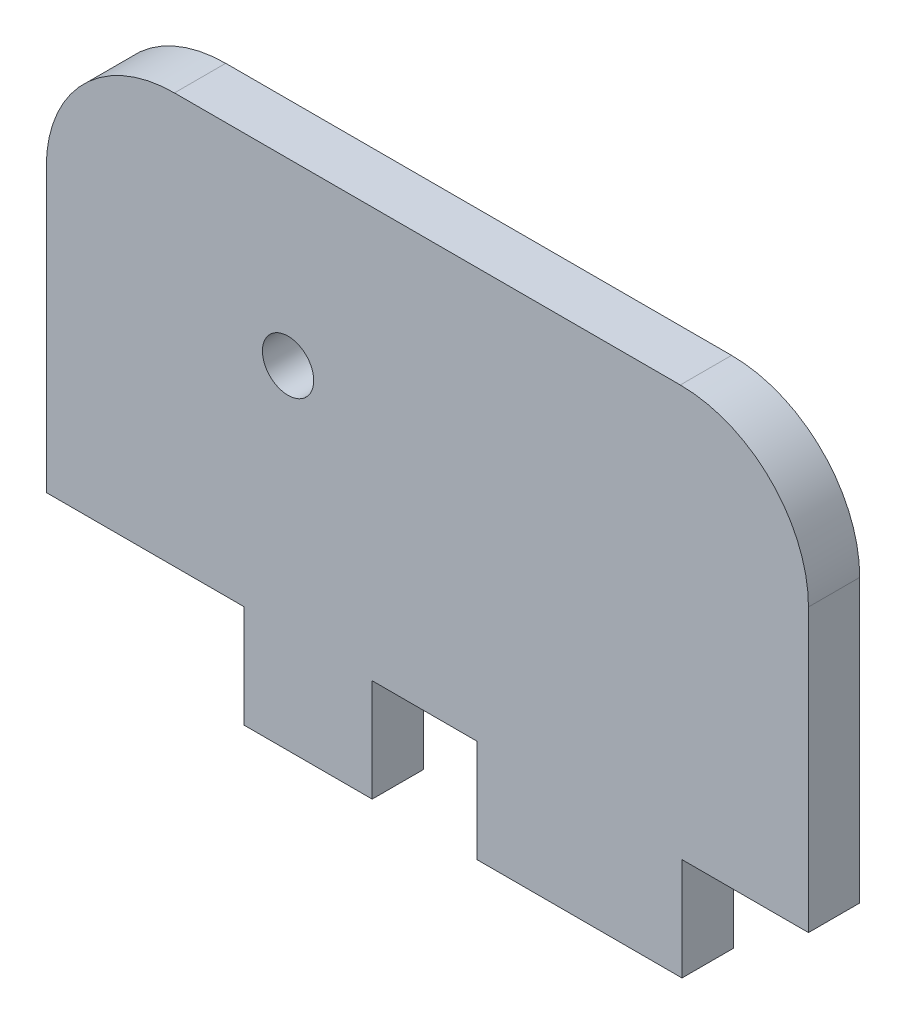
ISO-10303-21;
HEADER;
FILE_DESCRIPTION(('STEP AP214'),'2;1');
FILE_NAME('part.step','',(''),(''),'','','');
FILE_SCHEMA(('AUTOMOTIVE_DESIGN { 1 0 10303 214 1 1 1 1 }'));
ENDSEC;
DATA;
#1=APPLICATION_CONTEXT('core data for automotive mechanical design processes');
#2=APPLICATION_PROTOCOL_DEFINITION('international standard','automotive_design',2000,#1);
#3=PRODUCT_CONTEXT('',#1,'mechanical');
#4=PRODUCT('Part','Part','',(#3));
#5=PRODUCT_RELATED_PRODUCT_CATEGORY('part','',(#4));
#6=PRODUCT_DEFINITION_FORMATION('','',#4);
#7=PRODUCT_DEFINITION_CONTEXT('part definition',#1,'design');
#8=PRODUCT_DEFINITION('design','',#6,#7);
#9=PRODUCT_DEFINITION_SHAPE('','',#8);
#10=(LENGTH_UNIT() NAMED_UNIT(*) SI_UNIT(.MILLI.,.METRE.));
#11=(NAMED_UNIT(*) PLANE_ANGLE_UNIT() SI_UNIT($,.RADIAN.));
#12=(NAMED_UNIT(*) SI_UNIT($,.STERADIAN.) SOLID_ANGLE_UNIT());
#13=UNCERTAINTY_MEASURE_WITH_UNIT(LENGTH_MEASURE(1.E-05),#10,'distance_accuracy_value','');
#14=(GEOMETRIC_REPRESENTATION_CONTEXT(3) GLOBAL_UNCERTAINTY_ASSIGNED_CONTEXT((#13)) GLOBAL_UNIT_ASSIGNED_CONTEXT((#10,
#11,#12)) REPRESENTATION_CONTEXT('',''));
#15=CARTESIAN_POINT('',(0.,0.,0.));
#16=DIRECTION('',(0.,0.,1.));
#17=DIRECTION('',(1.,0.,0.));
#18=AXIS2_PLACEMENT_3D('',#15,#16,#17);
#19=CARTESIAN_POINT('',(-9.86584110472118,10.,2.));
#20=DIRECTION('',(0.,0.,-1.));
#21=DIRECTION('',(-1.,0.,0.));
#22=AXIS2_PLACEMENT_3D('',#19,#20,#21);
#23=PLANE('',#22);
#24=DIRECTION('',(0.,1.,0.));
#25=VECTOR('',#24,1.);
#26=CARTESIAN_POINT('',(-2.15187398526033,-1.,2.));
#27=LINE('',#26,#25);
#28=CARTESIAN_POINT('',(-2.15187398526033,-5.,2.));
#29=VERTEX_POINT('',#28);
#30=CARTESIAN_POINT('',(-2.15187398526033,-1.,2.));
#31=VERTEX_POINT('',#30);
#32=EDGE_CURVE('E193',#29,#31,#27,.T.);
#33=ORIENTED_EDGE('',*,*,#32,.T.);
#34=DIRECTION('',(1.,0.,0.));
#35=VECTOR('',#34,1.);
#36=CARTESIAN_POINT('',(1.93266689999142,-1.,2.));
#37=LINE('',#36,#35);
#38=CARTESIAN_POINT('',(1.93266689999142,-1.,2.));
#39=VERTEX_POINT('',#38);
#40=EDGE_CURVE('E111',#31,#39,#37,.T.);
#41=ORIENTED_EDGE('',*,*,#40,.T.);
#42=DIRECTION('',(0.,-1.,0.));
#43=VECTOR('',#42,1.);
#44=CARTESIAN_POINT('',(1.93266689999142,-5.,2.));
#45=LINE('',#44,#43);
#46=CARTESIAN_POINT('',(1.93266689999142,-5.,2.));
#47=VERTEX_POINT('',#46);
#48=EDGE_CURVE('E226',#39,#47,#45,.T.);
#49=ORIENTED_EDGE('',*,*,#48,.T.);
#50=DIRECTION('',(1.,0.,0.));
#51=VECTOR('',#50,1.);
#52=CARTESIAN_POINT('',(9.93266689999142,-5.,2.));
#53=LINE('',#52,#51);
#54=CARTESIAN_POINT('',(9.93266689999142,-5.,2.));
#55=VERTEX_POINT('',#54);
#56=EDGE_CURVE('E245',#47,#55,#53,.T.);
#57=ORIENTED_EDGE('',*,*,#56,.T.);
#58=DIRECTION('',(0.,1.,0.));
#59=VECTOR('',#58,1.);
#60=CARTESIAN_POINT('',(9.93266689999142,-1.,2.));
#61=LINE('',#60,#59);
#62=CARTESIAN_POINT('',(9.93266689999142,-1.,2.));
#63=VERTEX_POINT('',#62);
#64=EDGE_CURVE('E242',#55,#63,#61,.T.);
#65=ORIENTED_EDGE('',*,*,#64,.T.);
#66=DIRECTION('',(1.,0.,0.));
#67=VECTOR('',#66,1.);
#68=CARTESIAN_POINT('',(9.93266689999142,-1.,2.));
#69=LINE('',#68,#67);
#70=CARTESIAN_POINT('',(14.8658411047212,-1.,2.));
#71=VERTEX_POINT('',#70);
#72=EDGE_CURVE('E244',#63,#71,#69,.T.);
#73=ORIENTED_EDGE('',*,*,#72,.T.);
#74=DIRECTION('',(0.,1.,0.));
#75=VECTOR('',#74,1.);
#76=CARTESIAN_POINT('',(14.8658411047212,9.99999999999996,2.));
#77=LINE('',#76,#75);
#78=CARTESIAN_POINT('',(14.8658411047212,9.99999999999996,2.));
#79=VERTEX_POINT('',#78);
#80=EDGE_CURVE('E247',#71,#79,#77,.T.);
#81=ORIENTED_EDGE('',*,*,#80,.T.);
#82=CARTESIAN_POINT('',(9.86584110472118,10.,2.));
#83=DIRECTION('',(0.,0.,1.));
#84=DIRECTION('',(1.,0.,0.));
#85=AXIS2_PLACEMENT_3D('',#82,#83,#84);
#86=CIRCLE('',#85,5.);
#87=CARTESIAN_POINT('',(9.86584110472115,15.,2.));
#88=VERTEX_POINT('',#87);
#89=EDGE_CURVE('E253',#79,#88,#86,.T.);
#90=ORIENTED_EDGE('',*,*,#89,.T.);
#91=DIRECTION('',(-1.,0.,0.));
#92=VECTOR('',#91,1.);
#93=CARTESIAN_POINT('',(9.86584110472115,15.,2.));
#94=LINE('',#93,#92);
#95=CARTESIAN_POINT('',(-9.86584110472115,15.,2.));
#96=VERTEX_POINT('',#95);
#97=EDGE_CURVE('E255',#88,#96,#94,.T.);
#98=ORIENTED_EDGE('',*,*,#97,.T.);
#99=CARTESIAN_POINT('',(-9.86584110472118,10.,2.));
#100=DIRECTION('',(0.,0.,1.));
#101=DIRECTION('',(-1.,0.,0.));
#102=AXIS2_PLACEMENT_3D('',#99,#100,#101);
#103=CIRCLE('',#102,5.);
#104=CARTESIAN_POINT('',(-14.8658411047212,9.99999999999996,2.));
#105=VERTEX_POINT('',#104);
#106=EDGE_CURVE('E257',#96,#105,#103,.T.);
#107=ORIENTED_EDGE('',*,*,#106,.T.);
#108=DIRECTION('',(0.,-1.,0.));
#109=VECTOR('',#108,1.);
#110=CARTESIAN_POINT('',(-14.8658411047212,9.99999999999996,2.));
#111=LINE('',#110,#109);
#112=CARTESIAN_POINT('',(-14.8658411047212,-1.00000000000001,2.));
#113=VERTEX_POINT('',#112);
#114=EDGE_CURVE('E148',#105,#113,#111,.T.);
#115=ORIENTED_EDGE('',*,*,#114,.T.);
#116=DIRECTION('',(1.,0.,0.));
#117=VECTOR('',#116,1.);
#118=CARTESIAN_POINT('',(-7.15187398526034,-1.,2.));
#119=LINE('',#118,#117);
#120=CARTESIAN_POINT('',(-7.15187398526034,-1.,2.));
#121=VERTEX_POINT('',#120);
#122=EDGE_CURVE('E142',#113,#121,#119,.T.);
#123=ORIENTED_EDGE('',*,*,#122,.T.);
#124=DIRECTION('',(0.,-1.,0.));
#125=VECTOR('',#124,1.);
#126=CARTESIAN_POINT('',(-7.15187398526034,-1.,2.));
#127=LINE('',#126,#125);
#128=CARTESIAN_POINT('',(-7.15187398526034,-5.00000000000001,2.));
#129=VERTEX_POINT('',#128);
#130=EDGE_CURVE('E146',#121,#129,#127,.T.);
#131=ORIENTED_EDGE('',*,*,#130,.T.);
#132=DIRECTION('',(1.,0.,0.));
#133=VECTOR('',#132,1.);
#134=CARTESIAN_POINT('',(-7.15187398526034,-5.00000000000001,2.));
#135=LINE('',#134,#133);
#136=EDGE_CURVE('E50',#129,#29,#135,.T.);
#137=ORIENTED_EDGE('',*,*,#136,.T.);
#138=EDGE_LOOP('',(#33,#41,#49,#57,#65,#73,#81,#90,#98,#107,#115,#123,#131,#137));
#139=FACE_BOUND('',#138,.T.);
#140=CARTESIAN_POINT('',(-5.43415889527882,8.,2.));
#141=DIRECTION('',(0.,0.,1.));
#142=DIRECTION('',(1.,0.,0.));
#143=AXIS2_PLACEMENT_3D('',#140,#141,#142);
#144=CIRCLE('',#143,1.);
#145=CARTESIAN_POINT('',(-4.43415889527882,8.,2.));
#146=VERTEX_POINT('',#145);
#147=EDGE_CURVE('E170',#146,#146,#144,.T.);
#148=ORIENTED_EDGE('',*,*,#147,.F.);
#149=EDGE_LOOP('',(#148));
#150=FACE_BOUND('',#149,.T.);
#151=ADVANCED_FACE('F33',(#139,#150),#23,.F.);
#152=CARTESIAN_POINT('',(-9.86584110472118,10.,0.));
#153=DIRECTION('',(0.,0.,-1.));
#154=DIRECTION('',(-1.,0.,0.));
#155=AXIS2_PLACEMENT_3D('',#152,#153,#154);
#156=PLANE('',#155);
#157=DIRECTION('',(0.,1.,0.));
#158=VECTOR('',#157,1.);
#159=CARTESIAN_POINT('',(-2.15187398526033,-1.,0.));
#160=LINE('',#159,#158);
#161=CARTESIAN_POINT('',(-2.15187398526033,-5.,0.));
#162=VERTEX_POINT('',#161);
#163=CARTESIAN_POINT('',(-2.15187398526033,-1.,0.));
#164=VERTEX_POINT('',#163);
#165=EDGE_CURVE('E166',#162,#164,#160,.T.);
#166=ORIENTED_EDGE('',*,*,#165,.F.);
#167=DIRECTION('',(1.,0.,0.));
#168=VECTOR('',#167,1.);
#169=CARTESIAN_POINT('',(-7.15187398526034,-5.00000000000001,0.));
#170=LINE('',#169,#168);
#171=CARTESIAN_POINT('',(-7.15187398526034,-5.00000000000001,0.));
#172=VERTEX_POINT('',#171);
#173=EDGE_CURVE('E103',#172,#162,#170,.T.);
#174=ORIENTED_EDGE('',*,*,#173,.F.);
#175=DIRECTION('',(0.,-1.,0.));
#176=VECTOR('',#175,1.);
#177=CARTESIAN_POINT('',(-7.15187398526034,-1.,0.));
#178=LINE('',#177,#176);
#179=CARTESIAN_POINT('',(-7.15187398526034,-1.,0.));
#180=VERTEX_POINT('',#179);
#181=EDGE_CURVE('E97',#180,#172,#178,.T.);
#182=ORIENTED_EDGE('',*,*,#181,.F.);
#183=DIRECTION('',(1.,0.,0.));
#184=VECTOR('',#183,1.);
#185=CARTESIAN_POINT('',(-7.15187398526034,-1.,0.));
#186=LINE('',#185,#184);
#187=CARTESIAN_POINT('',(-14.8658411047212,-1.00000000000001,0.));
#188=VERTEX_POINT('',#187);
#189=EDGE_CURVE('E156',#188,#180,#186,.T.);
#190=ORIENTED_EDGE('',*,*,#189,.F.);
#191=DIRECTION('',(0.,-1.,0.));
#192=VECTOR('',#191,1.);
#193=CARTESIAN_POINT('',(-14.8658411047212,9.99999999999996,0.));
#194=LINE('',#193,#192);
#195=CARTESIAN_POINT('',(-14.8658411047212,9.99999999999996,0.));
#196=VERTEX_POINT('',#195);
#197=EDGE_CURVE('E188',#196,#188,#194,.T.);
#198=ORIENTED_EDGE('',*,*,#197,.F.);
#199=CARTESIAN_POINT('',(-9.86584110472118,10.,0.));
#200=DIRECTION('',(0.,0.,1.));
#201=DIRECTION('',(-1.,0.,0.));
#202=AXIS2_PLACEMENT_3D('',#199,#200,#201);
#203=CIRCLE('',#202,5.);
#204=CARTESIAN_POINT('',(-9.86584110472115,15.,0.));
#205=VERTEX_POINT('',#204);
#206=EDGE_CURVE('E186',#205,#196,#203,.T.);
#207=ORIENTED_EDGE('',*,*,#206,.F.);
#208=DIRECTION('',(-1.,0.,0.));
#209=VECTOR('',#208,1.);
#210=CARTESIAN_POINT('',(9.86584110472115,15.,0.));
#211=LINE('',#210,#209);
#212=CARTESIAN_POINT('',(9.86584110472115,15.,0.));
#213=VERTEX_POINT('',#212);
#214=EDGE_CURVE('E184',#213,#205,#211,.T.);
#215=ORIENTED_EDGE('',*,*,#214,.F.);
#216=CARTESIAN_POINT('',(9.86584110472118,10.,0.));
#217=DIRECTION('',(0.,0.,1.));
#218=DIRECTION('',(1.,0.,0.));
#219=AXIS2_PLACEMENT_3D('',#216,#217,#218);
#220=CIRCLE('',#219,5.);
#221=CARTESIAN_POINT('',(14.8658411047212,9.99999999999996,0.));
#222=VERTEX_POINT('',#221);
#223=EDGE_CURVE('E182',#222,#213,#220,.T.);
#224=ORIENTED_EDGE('',*,*,#223,.F.);
#225=DIRECTION('',(0.,1.,0.));
#226=VECTOR('',#225,1.);
#227=CARTESIAN_POINT('',(14.8658411047212,9.99999999999996,0.));
#228=LINE('',#227,#226);
#229=CARTESIAN_POINT('',(14.8658411047212,-1.,0.));
#230=VERTEX_POINT('',#229);
#231=EDGE_CURVE('E180',#230,#222,#228,.T.);
#232=ORIENTED_EDGE('',*,*,#231,.F.);
#233=DIRECTION('',(1.,0.,0.));
#234=VECTOR('',#233,1.);
#235=CARTESIAN_POINT('',(9.93266689999142,-1.,0.));
#236=LINE('',#235,#234);
#237=CARTESIAN_POINT('',(9.93266689999142,-1.,0.));
#238=VERTEX_POINT('',#237);
#239=EDGE_CURVE('E178',#238,#230,#236,.T.);
#240=ORIENTED_EDGE('',*,*,#239,.F.);
#241=DIRECTION('',(0.,1.,0.));
#242=VECTOR('',#241,1.);
#243=CARTESIAN_POINT('',(9.93266689999142,-1.,0.));
#244=LINE('',#243,#242);
#245=CARTESIAN_POINT('',(9.93266689999142,-5.,0.));
#246=VERTEX_POINT('',#245);
#247=EDGE_CURVE('E176',#246,#238,#244,.T.);
#248=ORIENTED_EDGE('',*,*,#247,.F.);
#249=DIRECTION('',(1.,0.,0.));
#250=VECTOR('',#249,1.);
#251=CARTESIAN_POINT('',(9.93266689999142,-5.,0.));
#252=LINE('',#251,#250);
#253=CARTESIAN_POINT('',(1.93266689999142,-5.,0.));
#254=VERTEX_POINT('',#253);
#255=EDGE_CURVE('E174',#254,#246,#252,.T.);
#256=ORIENTED_EDGE('',*,*,#255,.F.);
#257=DIRECTION('',(0.,-1.,0.));
#258=VECTOR('',#257,1.);
#259=CARTESIAN_POINT('',(1.93266689999142,-5.,0.));
#260=LINE('',#259,#258);
#261=CARTESIAN_POINT('',(1.93266689999142,-1.,0.));
#262=VERTEX_POINT('',#261);
#263=EDGE_CURVE('E172',#262,#254,#260,.T.);
#264=ORIENTED_EDGE('',*,*,#263,.F.);
#265=DIRECTION('',(1.,0.,0.));
#266=VECTOR('',#265,1.);
#267=CARTESIAN_POINT('',(1.93266689999142,-1.,0.));
#268=LINE('',#267,#266);
#269=EDGE_CURVE('E169',#164,#262,#268,.T.);
#270=ORIENTED_EDGE('',*,*,#269,.F.);
#271=EDGE_LOOP('',(#166,#174,#182,#190,#198,#207,#215,#224,#232,#240,#248,#256,#264,#270));
#272=FACE_BOUND('',#271,.T.);
#273=CARTESIAN_POINT('',(-5.43415889527882,8.,0.));
#274=DIRECTION('',(0.,0.,1.));
#275=DIRECTION('',(1.,0.,0.));
#276=AXIS2_PLACEMENT_3D('',#273,#274,#275);
#277=CIRCLE('',#276,1.);
#278=CARTESIAN_POINT('',(-4.43415889527882,8.,0.));
#279=VERTEX_POINT('',#278);
#280=EDGE_CURVE('E430',#279,#279,#277,.T.);
#281=ORIENTED_EDGE('',*,*,#280,.T.);
#282=EDGE_LOOP('',(#281));
#283=FACE_BOUND('',#282,.T.);
#284=ADVANCED_FACE('F230',(#272,#283),#156,.T.);
#285=CARTESIAN_POINT('',(-2.15187398526033,-1.,2.));
#286=DIRECTION('',(-1.,0.,0.));
#287=DIRECTION('',(0.,0.,1.));
#288=AXIS2_PLACEMENT_3D('',#285,#286,#287);
#289=PLANE('',#288);
#290=ORIENTED_EDGE('',*,*,#165,.T.);
#291=DIRECTION('',(0.,0.,-1.));
#292=VECTOR('',#291,1.);
#293=CARTESIAN_POINT('',(-2.15187398526033,-1.,2.));
#294=LINE('',#293,#292);
#295=EDGE_CURVE('E11',#31,#164,#294,.T.);
#296=ORIENTED_EDGE('',*,*,#295,.F.);
#297=ORIENTED_EDGE('',*,*,#32,.F.);
#298=DIRECTION('',(0.,0.,-1.));
#299=VECTOR('',#298,1.);
#300=CARTESIAN_POINT('',(-2.15187398526033,-5.,2.));
#301=LINE('',#300,#299);
#302=EDGE_CURVE('E162',#29,#162,#301,.T.);
#303=ORIENTED_EDGE('',*,*,#302,.T.);
#304=EDGE_LOOP('',(#290,#296,#297,#303));
#305=FACE_BOUND('',#304,.T.);
#306=ADVANCED_FACE('F35',(#305),#289,.F.);
#307=CARTESIAN_POINT('',(1.93266689999142,-1.,2.));
#308=DIRECTION('',(0.,1.,0.));
#309=DIRECTION('',(-1.,0.,0.));
#310=AXIS2_PLACEMENT_3D('',#307,#308,#309);
#311=PLANE('',#310);
#312=ORIENTED_EDGE('',*,*,#269,.T.);
#313=DIRECTION('',(0.,0.,-1.));
#314=VECTOR('',#313,1.);
#315=CARTESIAN_POINT('',(1.93266689999142,-1.,2.));
#316=LINE('',#315,#314);
#317=EDGE_CURVE('E42',#39,#262,#316,.T.);
#318=ORIENTED_EDGE('',*,*,#317,.F.);
#319=ORIENTED_EDGE('',*,*,#40,.F.);
#320=ORIENTED_EDGE('',*,*,#295,.T.);
#321=EDGE_LOOP('',(#312,#318,#319,#320));
#322=FACE_BOUND('',#321,.T.);
#323=ADVANCED_FACE('F291',(#322),#311,.F.);
#324=CARTESIAN_POINT('',(1.93266689999142,-5.,2.));
#325=DIRECTION('',(1.,0.,0.));
#326=DIRECTION('',(0.,0.,-1.));
#327=AXIS2_PLACEMENT_3D('',#324,#325,#326);
#328=PLANE('',#327);
#329=ORIENTED_EDGE('',*,*,#263,.T.);
#330=DIRECTION('',(0.,0.,-1.));
#331=VECTOR('',#330,1.);
#332=CARTESIAN_POINT('',(1.93266689999142,-5.,2.));
#333=LINE('',#332,#331);
#334=EDGE_CURVE('E218',#47,#254,#333,.T.);
#335=ORIENTED_EDGE('',*,*,#334,.F.);
#336=ORIENTED_EDGE('',*,*,#48,.F.);
#337=ORIENTED_EDGE('',*,*,#317,.T.);
#338=EDGE_LOOP('',(#329,#335,#336,#337));
#339=FACE_BOUND('',#338,.T.);
#340=ADVANCED_FACE('F224',(#339),#328,.F.);
#341=CARTESIAN_POINT('',(9.93266689999142,-5.,2.));
#342=DIRECTION('',(0.,1.,0.));
#343=DIRECTION('',(-1.,0.,0.));
#344=AXIS2_PLACEMENT_3D('',#341,#342,#343);
#345=PLANE('',#344);
#346=ORIENTED_EDGE('',*,*,#255,.T.);
#347=DIRECTION('',(0.,0.,-1.));
#348=VECTOR('',#347,1.);
#349=CARTESIAN_POINT('',(9.93266689999142,-5.,2.));
#350=LINE('',#349,#348);
#351=EDGE_CURVE('E215',#55,#246,#350,.T.);
#352=ORIENTED_EDGE('',*,*,#351,.F.);
#353=ORIENTED_EDGE('',*,*,#56,.F.);
#354=ORIENTED_EDGE('',*,*,#334,.T.);
#355=EDGE_LOOP('',(#346,#352,#353,#354));
#356=FACE_BOUND('',#355,.T.);
#357=ADVANCED_FACE('F236',(#356),#345,.F.);
#358=CARTESIAN_POINT('',(9.93266689999142,-1.,2.));
#359=DIRECTION('',(-1.,0.,0.));
#360=DIRECTION('',(0.,0.,1.));
#361=AXIS2_PLACEMENT_3D('',#358,#359,#360);
#362=PLANE('',#361);
#363=ORIENTED_EDGE('',*,*,#247,.T.);
#364=DIRECTION('',(0.,0.,-1.));
#365=VECTOR('',#364,1.);
#366=CARTESIAN_POINT('',(9.93266689999142,-1.,2.));
#367=LINE('',#366,#365);
#368=EDGE_CURVE('E212',#63,#238,#367,.T.);
#369=ORIENTED_EDGE('',*,*,#368,.F.);
#370=ORIENTED_EDGE('',*,*,#64,.F.);
#371=ORIENTED_EDGE('',*,*,#351,.T.);
#372=EDGE_LOOP('',(#363,#369,#370,#371));
#373=FACE_BOUND('',#372,.T.);
#374=ADVANCED_FACE('F240',(#373),#362,.F.);
#375=CARTESIAN_POINT('',(9.93266689999142,-1.,2.));
#376=DIRECTION('',(0.,1.,0.));
#377=DIRECTION('',(0.,0.,1.));
#378=AXIS2_PLACEMENT_3D('',#375,#376,#377);
#379=PLANE('',#378);
#380=ORIENTED_EDGE('',*,*,#239,.T.);
#381=DIRECTION('',(0.,0.,-1.));
#382=VECTOR('',#381,1.);
#383=CARTESIAN_POINT('',(14.8658411047212,-1.,2.));
#384=LINE('',#383,#382);
#385=EDGE_CURVE('E209',#71,#230,#384,.T.);
#386=ORIENTED_EDGE('',*,*,#385,.F.);
#387=ORIENTED_EDGE('',*,*,#72,.F.);
#388=ORIENTED_EDGE('',*,*,#368,.T.);
#389=EDGE_LOOP('',(#380,#386,#387,#388));
#390=FACE_BOUND('',#389,.T.);
#391=ADVANCED_FACE('F304',(#390),#379,.F.);
#392=CARTESIAN_POINT('',(14.8658411047212,9.99999999999996,2.));
#393=DIRECTION('',(-1.,0.,0.));
#394=DIRECTION('',(0.,-1.,0.));
#395=AXIS2_PLACEMENT_3D('',#392,#393,#394);
#396=PLANE('',#395);
#397=ORIENTED_EDGE('',*,*,#231,.T.);
#398=DIRECTION('',(0.,0.,-1.));
#399=VECTOR('',#398,1.);
#400=CARTESIAN_POINT('',(14.8658411047212,9.99999999999996,2.));
#401=LINE('',#400,#399);
#402=EDGE_CURVE('E206',#79,#222,#401,.T.);
#403=ORIENTED_EDGE('',*,*,#402,.F.);
#404=ORIENTED_EDGE('',*,*,#80,.F.);
#405=ORIENTED_EDGE('',*,*,#385,.T.);
#406=EDGE_LOOP('',(#397,#403,#404,#405));
#407=FACE_BOUND('',#406,.T.);
#408=ADVANCED_FACE('F307',(#407),#396,.F.);
#409=CARTESIAN_POINT('',(9.86584110472118,10.,2.));
#410=DIRECTION('',(0.,0.,-1.));
#411=DIRECTION('',(-1.,0.,0.));
#412=AXIS2_PLACEMENT_3D('',#409,#410,#411);
#413=CYLINDRICAL_SURFACE('',#412,5.);
#414=ORIENTED_EDGE('',*,*,#223,.T.);
#415=DIRECTION('',(0.,0.,-1.));
#416=VECTOR('',#415,1.);
#417=CARTESIAN_POINT('',(9.86584110472115,15.,2.));
#418=LINE('',#417,#416);
#419=EDGE_CURVE('E203',#88,#213,#418,.T.);
#420=ORIENTED_EDGE('',*,*,#419,.F.);
#421=ORIENTED_EDGE('',*,*,#89,.F.);
#422=ORIENTED_EDGE('',*,*,#402,.T.);
#423=EDGE_LOOP('',(#414,#420,#421,#422));
#424=FACE_BOUND('',#423,.T.);
#425=ADVANCED_FACE('F311',(#424),#413,.T.);
#426=CARTESIAN_POINT('',(9.86584110472115,15.,2.));
#427=DIRECTION('',(0.,-1.,0.));
#428=DIRECTION('',(1.,0.,0.));
#429=AXIS2_PLACEMENT_3D('',#426,#427,#428);
#430=PLANE('',#429);
#431=ORIENTED_EDGE('',*,*,#214,.T.);
#432=DIRECTION('',(0.,0.,-1.));
#433=VECTOR('',#432,1.);
#434=CARTESIAN_POINT('',(-9.86584110472115,15.,2.));
#435=LINE('',#434,#433);
#436=EDGE_CURVE('E200',#96,#205,#435,.T.);
#437=ORIENTED_EDGE('',*,*,#436,.F.);
#438=ORIENTED_EDGE('',*,*,#97,.F.);
#439=ORIENTED_EDGE('',*,*,#419,.T.);
#440=EDGE_LOOP('',(#431,#437,#438,#439));
#441=FACE_BOUND('',#440,.T.);
#442=ADVANCED_FACE('F315',(#441),#430,.F.);
#443=CARTESIAN_POINT('',(-9.86584110472118,10.,2.));
#444=DIRECTION('',(0.,0.,-1.));
#445=DIRECTION('',(-1.,0.,0.));
#446=AXIS2_PLACEMENT_3D('',#443,#444,#445);
#447=CYLINDRICAL_SURFACE('',#446,5.);
#448=ORIENTED_EDGE('',*,*,#206,.T.);
#449=DIRECTION('',(0.,0.,-1.));
#450=VECTOR('',#449,1.);
#451=CARTESIAN_POINT('',(-14.8658411047212,9.99999999999996,2.));
#452=LINE('',#451,#450);
#453=EDGE_CURVE('E197',#105,#196,#452,.T.);
#454=ORIENTED_EDGE('',*,*,#453,.F.);
#455=ORIENTED_EDGE('',*,*,#106,.F.);
#456=ORIENTED_EDGE('',*,*,#436,.T.);
#457=EDGE_LOOP('',(#448,#454,#455,#456));
#458=FACE_BOUND('',#457,.T.);
#459=ADVANCED_FACE('F263',(#458),#447,.T.);
#460=CARTESIAN_POINT('',(-14.8658411047212,9.99999999999996,2.));
#461=DIRECTION('',(1.,0.,0.));
#462=DIRECTION('',(0.,0.,-1.));
#463=AXIS2_PLACEMENT_3D('',#460,#461,#462);
#464=PLANE('',#463);
#465=ORIENTED_EDGE('',*,*,#197,.T.);
#466=DIRECTION('',(0.,0.,-1.));
#467=VECTOR('',#466,1.);
#468=CARTESIAN_POINT('',(-14.8658411047212,-1.00000000000001,2.));
#469=LINE('',#468,#467);
#470=EDGE_CURVE('E157',#113,#188,#469,.T.);
#471=ORIENTED_EDGE('',*,*,#470,.F.);
#472=ORIENTED_EDGE('',*,*,#114,.F.);
#473=ORIENTED_EDGE('',*,*,#453,.T.);
#474=EDGE_LOOP('',(#465,#471,#472,#473));
#475=FACE_BOUND('',#474,.T.);
#476=ADVANCED_FACE('F267',(#475),#464,.F.);
#477=CARTESIAN_POINT('',(-7.15187398526034,-1.,2.));
#478=DIRECTION('',(0.,1.,0.));
#479=DIRECTION('',(-1.,0.,0.));
#480=AXIS2_PLACEMENT_3D('',#477,#478,#479);
#481=PLANE('',#480);
#482=ORIENTED_EDGE('',*,*,#189,.T.);
#483=DIRECTION('',(0.,0.,-1.));
#484=VECTOR('',#483,1.);
#485=CARTESIAN_POINT('',(-7.15187398526034,-1.,2.));
#486=LINE('',#485,#484);
#487=EDGE_CURVE('E153',#121,#180,#486,.T.);
#488=ORIENTED_EDGE('',*,*,#487,.F.);
#489=ORIENTED_EDGE('',*,*,#122,.F.);
#490=ORIENTED_EDGE('',*,*,#470,.T.);
#491=EDGE_LOOP('',(#482,#488,#489,#490));
#492=FACE_BOUND('',#491,.T.);
#493=ADVANCED_FACE('F154',(#492),#481,.F.);
#494=CARTESIAN_POINT('',(-7.15187398526034,-1.,2.));
#495=DIRECTION('',(1.,0.,0.));
#496=DIRECTION('',(0.,1.,0.));
#497=AXIS2_PLACEMENT_3D('',#494,#495,#496);
#498=PLANE('',#497);
#499=ORIENTED_EDGE('',*,*,#181,.T.);
#500=DIRECTION('',(0.,0.,-1.));
#501=VECTOR('',#500,1.);
#502=CARTESIAN_POINT('',(-7.15187398526034,-5.00000000000001,2.));
#503=LINE('',#502,#501);
#504=EDGE_CURVE('E158',#129,#172,#503,.T.);
#505=ORIENTED_EDGE('',*,*,#504,.F.);
#506=ORIENTED_EDGE('',*,*,#130,.F.);
#507=ORIENTED_EDGE('',*,*,#487,.T.);
#508=EDGE_LOOP('',(#499,#505,#506,#507));
#509=FACE_BOUND('',#508,.T.);
#510=ADVANCED_FACE('F160',(#509),#498,.F.);
#511=CARTESIAN_POINT('',(-7.15187398526034,-5.00000000000001,2.));
#512=DIRECTION('',(0.,1.,0.));
#513=DIRECTION('',(-1.,0.,0.));
#514=AXIS2_PLACEMENT_3D('',#511,#512,#513);
#515=PLANE('',#514);
#516=ORIENTED_EDGE('',*,*,#173,.T.);
#517=ORIENTED_EDGE('',*,*,#302,.F.);
#518=ORIENTED_EDGE('',*,*,#136,.F.);
#519=ORIENTED_EDGE('',*,*,#504,.T.);
#520=EDGE_LOOP('',(#516,#517,#518,#519));
#521=FACE_BOUND('',#520,.T.);
#522=ADVANCED_FACE('F271',(#521),#515,.F.);
#523=CARTESIAN_POINT('',(-5.43415889527882,8.,2.));
#524=DIRECTION('',(0.,0.,-1.));
#525=DIRECTION('',(-1.,0.,0.));
#526=AXIS2_PLACEMENT_3D('',#523,#524,#525);
#527=CYLINDRICAL_SURFACE('',#526,1.);
#528=ORIENTED_EDGE('',*,*,#147,.T.);
#529=EDGE_LOOP('',(#528));
#530=FACE_BOUND('',#529,.T.);
#531=ORIENTED_EDGE('',*,*,#280,.F.);
#532=EDGE_LOOP('',(#531));
#533=FACE_BOUND('',#532,.T.);
#534=ADVANCED_FACE('F273',(#530,#533),#527,.F.);
#535=CLOSED_SHELL('',(#151,#284,#306,#323,#340,#357,#374,#391,#408,#425,#442,#459,#476,#493,
#510,#522,#534));
#536=MANIFOLD_SOLID_BREP('B2',#535);
#537=ADVANCED_BREP_SHAPE_REPRESENTATION('',(#18,#536),#14);
#538=SHAPE_DEFINITION_REPRESENTATION(#9,#537);
ENDSEC;
END-ISO-10303-21;
